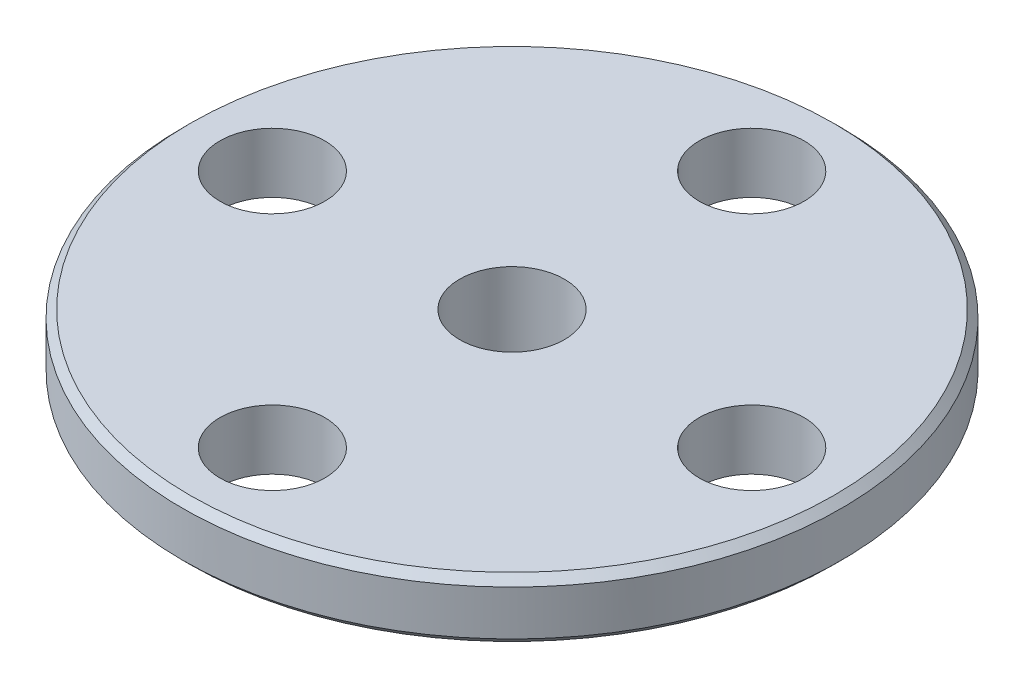
ISO-10303-21;
HEADER;
FILE_DESCRIPTION(('STEP AP214'),'2;1');
FILE_NAME('part.step','',(''),(''),'','','');
FILE_SCHEMA(('AUTOMOTIVE_DESIGN { 1 0 10303 214 1 1 1 1 }'));
ENDSEC;
DATA;
#1=APPLICATION_CONTEXT('core data for automotive mechanical design processes');
#2=APPLICATION_PROTOCOL_DEFINITION('international standard','automotive_design',2000,#1);
#3=PRODUCT_CONTEXT('',#1,'mechanical');
#4=PRODUCT('Part','Part','',(#3));
#5=PRODUCT_RELATED_PRODUCT_CATEGORY('part','',(#4));
#6=PRODUCT_DEFINITION_FORMATION('','',#4);
#7=PRODUCT_DEFINITION_CONTEXT('part definition',#1,'design');
#8=PRODUCT_DEFINITION('design','',#6,#7);
#9=PRODUCT_DEFINITION_SHAPE('','',#8);
#10=(LENGTH_UNIT() NAMED_UNIT(*) SI_UNIT(.MILLI.,.METRE.));
#11=(NAMED_UNIT(*) PLANE_ANGLE_UNIT() SI_UNIT($,.RADIAN.));
#12=(NAMED_UNIT(*) SI_UNIT($,.STERADIAN.) SOLID_ANGLE_UNIT());
#13=UNCERTAINTY_MEASURE_WITH_UNIT(LENGTH_MEASURE(1.E-05),#10,'distance_accuracy_value','');
#14=(GEOMETRIC_REPRESENTATION_CONTEXT(3) GLOBAL_UNCERTAINTY_ASSIGNED_CONTEXT((#13)) GLOBAL_UNIT_ASSIGNED_CONTEXT((#10,
#11,#12)) REPRESENTATION_CONTEXT('',''));
#15=CARTESIAN_POINT('',(0.,0.,0.));
#16=DIRECTION('',(0.,0.,1.));
#17=DIRECTION('',(1.,0.,0.));
#18=AXIS2_PLACEMENT_3D('',#15,#16,#17);
#19=CARTESIAN_POINT('',(0.,0.,0.));
#20=DIRECTION('',(0.,-1.,0.));
#21=DIRECTION('',(0.,0.,-1.));
#22=AXIS2_PLACEMENT_3D('',#19,#20,#21);
#23=CYLINDRICAL_SURFACE('',#22,11.);
#24=CARTESIAN_POINT('',(0.,-1.74999999999999,0.));
#25=DIRECTION('',(0.,1.,0.));
#26=DIRECTION('',(0.,0.,1.));
#27=AXIS2_PLACEMENT_3D('',#24,#25,#26);
#28=CIRCLE('',#27,11.);
#29=CARTESIAN_POINT('',(0.,-1.74999999999999,11.));
#30=VERTEX_POINT('',#29);
#31=EDGE_CURVE('E40',#30,#30,#28,.T.);
#32=ORIENTED_EDGE('',*,*,#31,.T.);
#33=EDGE_LOOP('',(#32));
#34=FACE_BOUND('',#33,.T.);
#35=CARTESIAN_POINT('',(0.,-0.25,0.));
#36=DIRECTION('',(0.,-1.,0.));
#37=DIRECTION('',(0.,0.,-1.));
#38=AXIS2_PLACEMENT_3D('',#35,#36,#37);
#39=CIRCLE('',#38,11.);
#40=CARTESIAN_POINT('',(0.,-0.25,-11.));
#41=VERTEX_POINT('',#40);
#42=EDGE_CURVE('E44',#41,#41,#39,.T.);
#43=ORIENTED_EDGE('',*,*,#42,.T.);
#44=EDGE_LOOP('',(#43));
#45=FACE_BOUND('',#44,.T.);
#46=ADVANCED_FACE('F33',(#34,#45),#23,.T.);
#47=CARTESIAN_POINT('',(-11.,-2.,0.));
#48=DIRECTION('',(0.,1.,0.));
#49=DIRECTION('',(0.,0.,1.));
#50=AXIS2_PLACEMENT_3D('',#47,#48,#49);
#51=PLANE('',#50);
#52=CARTESIAN_POINT('',(0.,-2.,0.));
#53=DIRECTION('',(0.,1.,0.));
#54=DIRECTION('',(0.,0.,1.));
#55=AXIS2_PLACEMENT_3D('',#52,#53,#54);
#56=CIRCLE('',#55,10.75);
#57=CARTESIAN_POINT('',(0.,-2.,10.75));
#58=VERTEX_POINT('',#57);
#59=EDGE_CURVE('E48',#58,#58,#56,.F.);
#60=ORIENTED_EDGE('',*,*,#59,.T.);
#61=EDGE_LOOP('',(#60));
#62=FACE_BOUND('',#61,.T.);
#63=CARTESIAN_POINT('',(0.,-2.,-8.));
#64=DIRECTION('',(0.,1.,0.));
#65=DIRECTION('',(0.,0.,1.));
#66=AXIS2_PLACEMENT_3D('',#63,#64,#65);
#67=CIRCLE('',#66,1.75);
#68=CARTESIAN_POINT('',(0.,-2.,-6.25));
#69=VERTEX_POINT('',#68);
#70=EDGE_CURVE('E92',#69,#69,#67,.T.);
#71=ORIENTED_EDGE('',*,*,#70,.T.);
#72=EDGE_LOOP('',(#71));
#73=FACE_BOUND('',#72,.T.);
#74=CARTESIAN_POINT('',(0.,-2.,8.));
#75=DIRECTION('',(0.,1.,0.));
#76=DIRECTION('',(0.,0.,1.));
#77=AXIS2_PLACEMENT_3D('',#74,#75,#76);
#78=CIRCLE('',#77,1.75);
#79=CARTESIAN_POINT('',(0.,-2.,9.75));
#80=VERTEX_POINT('',#79);
#81=EDGE_CURVE('E86',#80,#80,#78,.T.);
#82=ORIENTED_EDGE('',*,*,#81,.T.);
#83=EDGE_LOOP('',(#82));
#84=FACE_BOUND('',#83,.T.);
#85=CARTESIAN_POINT('',(-8.,-2.,0.));
#86=DIRECTION('',(0.,1.,0.));
#87=DIRECTION('',(0.,0.,1.));
#88=AXIS2_PLACEMENT_3D('',#85,#86,#87);
#89=CIRCLE('',#88,1.75);
#90=CARTESIAN_POINT('',(-8.,-2.,1.75));
#91=VERTEX_POINT('',#90);
#92=EDGE_CURVE('E80',#91,#91,#89,.T.);
#93=ORIENTED_EDGE('',*,*,#92,.T.);
#94=EDGE_LOOP('',(#93));
#95=FACE_BOUND('',#94,.T.);
#96=CARTESIAN_POINT('',(8.,-2.,0.));
#97=DIRECTION('',(0.,1.,0.));
#98=DIRECTION('',(0.,0.,1.));
#99=AXIS2_PLACEMENT_3D('',#96,#97,#98);
#100=CIRCLE('',#99,1.75);
#101=CARTESIAN_POINT('',(8.,-2.,1.75));
#102=VERTEX_POINT('',#101);
#103=EDGE_CURVE('E74',#102,#102,#100,.T.);
#104=ORIENTED_EDGE('',*,*,#103,.T.);
#105=EDGE_LOOP('',(#104));
#106=FACE_BOUND('',#105,.T.);
#107=CARTESIAN_POINT('',(0.,-2.,0.));
#108=DIRECTION('',(0.,-1.,0.));
#109=DIRECTION('',(0.,0.,-1.));
#110=AXIS2_PLACEMENT_3D('',#107,#108,#109);
#111=CIRCLE('',#110,4.4);
#112=CARTESIAN_POINT('',(0.,-2.,-4.4));
#113=VERTEX_POINT('',#112);
#114=EDGE_CURVE('E59',#113,#113,#111,.T.);
#115=ORIENTED_EDGE('',*,*,#114,.F.);
#116=EDGE_LOOP('',(#115));
#117=FACE_BOUND('',#116,.T.);
#118=ADVANCED_FACE('F141',(#62,#73,#84,#95,#106,#117),#51,.F.);
#119=CARTESIAN_POINT('',(0.,0.,0.));
#120=DIRECTION('',(0.,-1.,0.));
#121=DIRECTION('',(0.,0.,-1.));
#122=AXIS2_PLACEMENT_3D('',#119,#120,#121);
#123=CYLINDRICAL_SURFACE('',#122,4.4);
#124=CARTESIAN_POINT('',(0.,-5.95,0.));
#125=DIRECTION('',(0.,1.,0.));
#126=DIRECTION('',(0.,0.,1.));
#127=AXIS2_PLACEMENT_3D('',#124,#125,#126);
#128=CIRCLE('',#127,4.4);
#129=CARTESIAN_POINT('',(0.,-5.95,4.4));
#130=VERTEX_POINT('',#129);
#131=EDGE_CURVE('E53',#130,#130,#128,.T.);
#132=ORIENTED_EDGE('',*,*,#131,.T.);
#133=EDGE_LOOP('',(#132));
#134=FACE_BOUND('',#133,.T.);
#135=ORIENTED_EDGE('',*,*,#114,.T.);
#136=EDGE_LOOP('',(#135));
#137=FACE_BOUND('',#136,.T.);
#138=ADVANCED_FACE('F135',(#134,#137),#123,.T.);
#139=CARTESIAN_POINT('',(-4.4,-6.2,0.));
#140=DIRECTION('',(0.,1.,0.));
#141=DIRECTION('',(0.,0.,1.));
#142=AXIS2_PLACEMENT_3D('',#139,#140,#141);
#143=PLANE('',#142);
#144=CARTESIAN_POINT('',(0.,-6.2,0.));
#145=DIRECTION('',(0.,1.,0.));
#146=DIRECTION('',(0.,0.,1.));
#147=AXIS2_PLACEMENT_3D('',#144,#145,#146);
#148=CIRCLE('',#147,4.15);
#149=CARTESIAN_POINT('',(0.,-6.2,4.15));
#150=VERTEX_POINT('',#149);
#151=EDGE_CURVE('E56',#150,#150,#148,.F.);
#152=ORIENTED_EDGE('',*,*,#151,.T.);
#153=EDGE_LOOP('',(#152));
#154=FACE_BOUND('',#153,.T.);
#155=CARTESIAN_POINT('',(0.,-6.2,0.));
#156=DIRECTION('',(0.,-1.,0.));
#157=DIRECTION('',(0.,0.,-1.));
#158=AXIS2_PLACEMENT_3D('',#155,#156,#157);
#159=CIRCLE('',#158,2.85);
#160=CARTESIAN_POINT('',(0.,-6.2,-2.85));
#161=VERTEX_POINT('',#160);
#162=EDGE_CURVE('E62',#161,#161,#159,.T.);
#163=ORIENTED_EDGE('',*,*,#162,.F.);
#164=EDGE_LOOP('',(#163));
#165=FACE_BOUND('',#164,.T.);
#166=ADVANCED_FACE('F130',(#154,#165),#143,.F.);
#167=CARTESIAN_POINT('',(0.,0.,0.));
#168=DIRECTION('',(0.,-1.,0.));
#169=DIRECTION('',(0.,0.,-1.));
#170=AXIS2_PLACEMENT_3D('',#167,#168,#169);
#171=CYLINDRICAL_SURFACE('',#170,2.85);
#172=CARTESIAN_POINT('',(0.,-3.2,0.));
#173=DIRECTION('',(0.,-1.,0.));
#174=DIRECTION('',(0.,0.,-1.));
#175=AXIS2_PLACEMENT_3D('',#172,#173,#174);
#176=CIRCLE('',#175,2.85);
#177=CARTESIAN_POINT('',(0.,-3.2,-2.85));
#178=VERTEX_POINT('',#177);
#179=EDGE_CURVE('E65',#178,#178,#176,.T.);
#180=ORIENTED_EDGE('',*,*,#179,.F.);
#181=EDGE_LOOP('',(#180));
#182=FACE_BOUND('',#181,.T.);
#183=ORIENTED_EDGE('',*,*,#162,.T.);
#184=EDGE_LOOP('',(#183));
#185=FACE_BOUND('',#184,.T.);
#186=ADVANCED_FACE('F124',(#182,#185),#171,.F.);
#187=CARTESIAN_POINT('',(-2.85,-3.2,0.));
#188=DIRECTION('',(0.,1.,0.));
#189=DIRECTION('',(0.,0.,1.));
#190=AXIS2_PLACEMENT_3D('',#187,#188,#189);
#191=PLANE('',#190);
#192=CARTESIAN_POINT('',(0.,-3.2,0.));
#193=DIRECTION('',(0.,-1.,0.));
#194=DIRECTION('',(0.,0.,-1.));
#195=AXIS2_PLACEMENT_3D('',#192,#193,#194);
#196=CIRCLE('',#195,1.75);
#197=CARTESIAN_POINT('',(0.,-3.2,-1.75));
#198=VERTEX_POINT('',#197);
#199=EDGE_CURVE('E68',#198,#198,#196,.T.);
#200=ORIENTED_EDGE('',*,*,#199,.F.);
#201=EDGE_LOOP('',(#200));
#202=FACE_BOUND('',#201,.T.);
#203=ORIENTED_EDGE('',*,*,#179,.T.);
#204=EDGE_LOOP('',(#203));
#205=FACE_BOUND('',#204,.T.);
#206=ADVANCED_FACE('F118',(#202,#205),#191,.F.);
#207=CARTESIAN_POINT('',(0.,0.,0.));
#208=DIRECTION('',(0.,-1.,0.));
#209=DIRECTION('',(0.,0.,-1.));
#210=AXIS2_PLACEMENT_3D('',#207,#208,#209);
#211=CYLINDRICAL_SURFACE('',#210,1.75);
#212=CARTESIAN_POINT('',(0.,0.,0.));
#213=DIRECTION('',(0.,-1.,0.));
#214=DIRECTION('',(0.,0.,-1.));
#215=AXIS2_PLACEMENT_3D('',#212,#213,#214);
#216=CIRCLE('',#215,1.75);
#217=CARTESIAN_POINT('',(0.,0.,-1.75));
#218=VERTEX_POINT('',#217);
#219=EDGE_CURVE('E71',#218,#218,#216,.T.);
#220=ORIENTED_EDGE('',*,*,#219,.F.);
#221=EDGE_LOOP('',(#220));
#222=FACE_BOUND('',#221,.T.);
#223=ORIENTED_EDGE('',*,*,#199,.T.);
#224=EDGE_LOOP('',(#223));
#225=FACE_BOUND('',#224,.T.);
#226=ADVANCED_FACE('F106',(#222,#225),#211,.F.);
#227=CARTESIAN_POINT('',(-11.,0.,0.));
#228=DIRECTION('',(0.,-1.,0.));
#229=DIRECTION('',(0.,0.,-1.));
#230=AXIS2_PLACEMENT_3D('',#227,#228,#229);
#231=PLANE('',#230);
#232=CARTESIAN_POINT('',(0.,0.,0.));
#233=DIRECTION('',(0.,-1.,0.));
#234=DIRECTION('',(0.,0.,-1.));
#235=AXIS2_PLACEMENT_3D('',#232,#233,#234);
#236=CIRCLE('',#235,10.75);
#237=CARTESIAN_POINT('',(0.,0.,-10.75));
#238=VERTEX_POINT('',#237);
#239=EDGE_CURVE('E10',#238,#238,#236,.F.);
#240=ORIENTED_EDGE('',*,*,#239,.T.);
#241=EDGE_LOOP('',(#240));
#242=FACE_BOUND('',#241,.T.);
#243=CARTESIAN_POINT('',(0.,0.,-8.));
#244=DIRECTION('',(0.,1.,0.));
#245=DIRECTION('',(0.,0.,1.));
#246=AXIS2_PLACEMENT_3D('',#243,#244,#245);
#247=CIRCLE('',#246,1.75);
#248=CARTESIAN_POINT('',(0.,0.,-6.25));
#249=VERTEX_POINT('',#248);
#250=EDGE_CURVE('E95',#249,#249,#247,.T.);
#251=ORIENTED_EDGE('',*,*,#250,.F.);
#252=EDGE_LOOP('',(#251));
#253=FACE_BOUND('',#252,.T.);
#254=CARTESIAN_POINT('',(0.,0.,8.));
#255=DIRECTION('',(0.,1.,0.));
#256=DIRECTION('',(0.,0.,1.));
#257=AXIS2_PLACEMENT_3D('',#254,#255,#256);
#258=CIRCLE('',#257,1.75);
#259=CARTESIAN_POINT('',(0.,0.,9.75));
#260=VERTEX_POINT('',#259);
#261=EDGE_CURVE('E89',#260,#260,#258,.T.);
#262=ORIENTED_EDGE('',*,*,#261,.F.);
#263=EDGE_LOOP('',(#262));
#264=FACE_BOUND('',#263,.T.);
#265=CARTESIAN_POINT('',(-8.,0.,0.));
#266=DIRECTION('',(0.,1.,0.));
#267=DIRECTION('',(0.,0.,1.));
#268=AXIS2_PLACEMENT_3D('',#265,#266,#267);
#269=CIRCLE('',#268,1.75);
#270=CARTESIAN_POINT('',(-8.,0.,1.75));
#271=VERTEX_POINT('',#270);
#272=EDGE_CURVE('E83',#271,#271,#269,.T.);
#273=ORIENTED_EDGE('',*,*,#272,.F.);
#274=EDGE_LOOP('',(#273));
#275=FACE_BOUND('',#274,.T.);
#276=CARTESIAN_POINT('',(8.,0.,0.));
#277=DIRECTION('',(0.,1.,0.));
#278=DIRECTION('',(0.,0.,1.));
#279=AXIS2_PLACEMENT_3D('',#276,#277,#278);
#280=CIRCLE('',#279,1.75);
#281=CARTESIAN_POINT('',(8.,0.,1.75));
#282=VERTEX_POINT('',#281);
#283=EDGE_CURVE('E77',#282,#282,#280,.T.);
#284=ORIENTED_EDGE('',*,*,#283,.F.);
#285=EDGE_LOOP('',(#284));
#286=FACE_BOUND('',#285,.T.);
#287=ORIENTED_EDGE('',*,*,#219,.T.);
#288=EDGE_LOOP('',(#287));
#289=FACE_BOUND('',#288,.T.);
#290=ADVANCED_FACE('F102',(#242,#253,#264,#275,#286,#289),#231,.F.);
#291=CARTESIAN_POINT('',(8.,0.,0.));
#292=DIRECTION('',(0.,1.,0.));
#293=DIRECTION('',(0.,0.,1.));
#294=AXIS2_PLACEMENT_3D('',#291,#292,#293);
#295=CYLINDRICAL_SURFACE('',#294,1.75);
#296=ORIENTED_EDGE('',*,*,#283,.T.);
#297=EDGE_LOOP('',(#296));
#298=FACE_BOUND('',#297,.T.);
#299=ORIENTED_EDGE('',*,*,#103,.F.);
#300=EDGE_LOOP('',(#299));
#301=FACE_BOUND('',#300,.T.);
#302=ADVANCED_FACE('F105',(#298,#301),#295,.F.);
#303=CARTESIAN_POINT('',(-8.,0.,0.));
#304=DIRECTION('',(0.,1.,0.));
#305=DIRECTION('',(0.,0.,1.));
#306=AXIS2_PLACEMENT_3D('',#303,#304,#305);
#307=CYLINDRICAL_SURFACE('',#306,1.75);
#308=ORIENTED_EDGE('',*,*,#272,.T.);
#309=EDGE_LOOP('',(#308));
#310=FACE_BOUND('',#309,.T.);
#311=ORIENTED_EDGE('',*,*,#92,.F.);
#312=EDGE_LOOP('',(#311));
#313=FACE_BOUND('',#312,.T.);
#314=ADVANCED_FACE('F178',(#310,#313),#307,.F.);
#315=CARTESIAN_POINT('',(0.,0.,8.));
#316=DIRECTION('',(0.,1.,0.));
#317=DIRECTION('',(0.,0.,1.));
#318=AXIS2_PLACEMENT_3D('',#315,#316,#317);
#319=CYLINDRICAL_SURFACE('',#318,1.75);
#320=ORIENTED_EDGE('',*,*,#261,.T.);
#321=EDGE_LOOP('',(#320));
#322=FACE_BOUND('',#321,.T.);
#323=ORIENTED_EDGE('',*,*,#81,.F.);
#324=EDGE_LOOP('',(#323));
#325=FACE_BOUND('',#324,.T.);
#326=ADVANCED_FACE('F184',(#322,#325),#319,.F.);
#327=CARTESIAN_POINT('',(0.,0.,-8.));
#328=DIRECTION('',(0.,1.,0.));
#329=DIRECTION('',(0.,0.,1.));
#330=AXIS2_PLACEMENT_3D('',#327,#328,#329);
#331=CYLINDRICAL_SURFACE('',#330,1.75);
#332=ORIENTED_EDGE('',*,*,#250,.T.);
#333=EDGE_LOOP('',(#332));
#334=FACE_BOUND('',#333,.T.);
#335=ORIENTED_EDGE('',*,*,#70,.F.);
#336=EDGE_LOOP('',(#335));
#337=FACE_BOUND('',#336,.T.);
#338=ADVANCED_FACE('F99',(#334,#337),#331,.F.);
#339=CARTESIAN_POINT('',(0.,-6.2,0.));
#340=DIRECTION('',(0.,1.,0.));
#341=DIRECTION('',(0.,0.,1.));
#342=AXIS2_PLACEMENT_3D('',#339,#340,#341);
#343=CONICAL_SURFACE('',#342,4.15,0.785398163397445);
#344=ORIENTED_EDGE('',*,*,#131,.F.);
#345=EDGE_LOOP('',(#344));
#346=FACE_BOUND('',#345,.T.);
#347=ORIENTED_EDGE('',*,*,#151,.F.);
#348=EDGE_LOOP('',(#347));
#349=FACE_BOUND('',#348,.T.);
#350=ADVANCED_FACE('F153',(#346,#349),#343,.T.);
#351=CARTESIAN_POINT('',(0.,-2.,0.));
#352=DIRECTION('',(0.,1.,0.));
#353=DIRECTION('',(0.,0.,1.));
#354=AXIS2_PLACEMENT_3D('',#351,#352,#353);
#355=CONICAL_SURFACE('',#354,10.75,0.785398163397428);
#356=ORIENTED_EDGE('',*,*,#31,.F.);
#357=EDGE_LOOP('',(#356));
#358=FACE_BOUND('',#357,.T.);
#359=ORIENTED_EDGE('',*,*,#59,.F.);
#360=EDGE_LOOP('',(#359));
#361=FACE_BOUND('',#360,.T.);
#362=ADVANCED_FACE('F155',(#358,#361),#355,.T.);
#363=CARTESIAN_POINT('',(0.,-0.25,0.));
#364=DIRECTION('',(0.,-1.,0.));
#365=DIRECTION('',(0.,0.,-1.));
#366=AXIS2_PLACEMENT_3D('',#363,#364,#365);
#367=CONICAL_SURFACE('',#366,11.,0.785398163397452);
#368=ORIENTED_EDGE('',*,*,#239,.F.);
#369=EDGE_LOOP('',(#368));
#370=FACE_BOUND('',#369,.T.);
#371=ORIENTED_EDGE('',*,*,#42,.F.);
#372=EDGE_LOOP('',(#371));
#373=FACE_BOUND('',#372,.T.);
#374=ADVANCED_FACE('F35',(#370,#373),#367,.T.);
#375=CLOSED_SHELL('',(#46,#118,#138,#166,#186,#206,#226,#290,#302,#314,#326,#338,#350,#362,#374));
#376=MANIFOLD_SOLID_BREP('B2',#375);
#377=ADVANCED_BREP_SHAPE_REPRESENTATION('',(#18,#376),#14);
#378=SHAPE_DEFINITION_REPRESENTATION(#9,#377);
ENDSEC;
END-ISO-10303-21;
